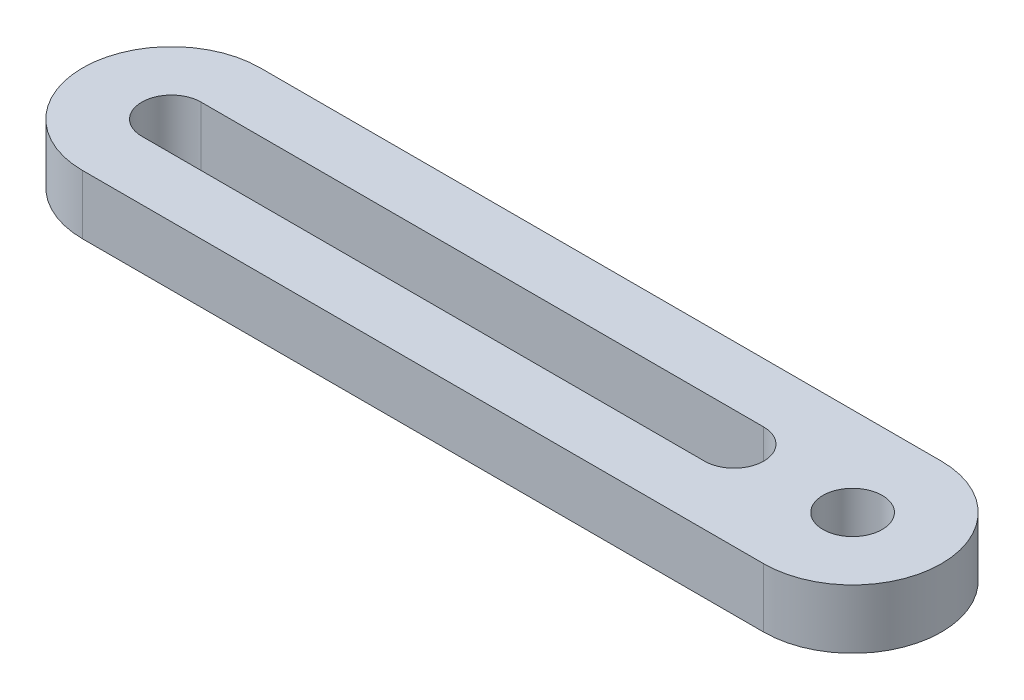
ISO-10303-21;
HEADER;
FILE_DESCRIPTION(('STEP AP214'),'2;1');
FILE_NAME('part.step','',(''),(''),'','','');
FILE_SCHEMA(('AUTOMOTIVE_DESIGN { 1 0 10303 214 1 1 1 1 }'));
ENDSEC;
DATA;
#1=APPLICATION_CONTEXT('core data for automotive mechanical design processes');
#2=APPLICATION_PROTOCOL_DEFINITION('international standard','automotive_design',2000,#1);
#3=PRODUCT_CONTEXT('',#1,'mechanical');
#4=PRODUCT('Part','Part','',(#3));
#5=PRODUCT_RELATED_PRODUCT_CATEGORY('part','',(#4));
#6=PRODUCT_DEFINITION_FORMATION('','',#4);
#7=PRODUCT_DEFINITION_CONTEXT('part definition',#1,'design');
#8=PRODUCT_DEFINITION('design','',#6,#7);
#9=PRODUCT_DEFINITION_SHAPE('','',#8);
#10=(LENGTH_UNIT() NAMED_UNIT(*) SI_UNIT(.MILLI.,.METRE.));
#11=(NAMED_UNIT(*) PLANE_ANGLE_UNIT() SI_UNIT($,.RADIAN.));
#12=(NAMED_UNIT(*) SI_UNIT($,.STERADIAN.) SOLID_ANGLE_UNIT());
#13=UNCERTAINTY_MEASURE_WITH_UNIT(LENGTH_MEASURE(1.E-05),#10,'distance_accuracy_value','');
#14=(GEOMETRIC_REPRESENTATION_CONTEXT(3) GLOBAL_UNCERTAINTY_ASSIGNED_CONTEXT((#13)) GLOBAL_UNIT_ASSIGNED_CONTEXT((#10,
#11,#12)) REPRESENTATION_CONTEXT('',''));
#15=CARTESIAN_POINT('',(0.,0.,0.));
#16=DIRECTION('',(0.,0.,1.));
#17=DIRECTION('',(1.,0.,0.));
#18=AXIS2_PLACEMENT_3D('',#15,#16,#17);
#19=CARTESIAN_POINT('',(0.,10.,0.));
#20=DIRECTION('',(0.,1.,0.));
#21=DIRECTION('',(0.,0.,1.));
#22=AXIS2_PLACEMENT_3D('',#19,#20,#21);
#23=PLANE('',#22);
#24=CARTESIAN_POINT('',(0.,10.,0.));
#25=DIRECTION('',(0.,1.,0.));
#26=DIRECTION('',(0.,0.,1.));
#27=AXIS2_PLACEMENT_3D('',#24,#25,#26);
#28=CIRCLE('',#27,15.);
#29=CARTESIAN_POINT('',(0.,10.,-15.));
#30=VERTEX_POINT('',#29);
#31=CARTESIAN_POINT('',(0.,10.,15.));
#32=VERTEX_POINT('',#31);
#33=EDGE_CURVE('E140',#30,#32,#28,.T.);
#34=ORIENTED_EDGE('',*,*,#33,.T.);
#35=DIRECTION('',(1.,0.,0.));
#36=VECTOR('',#35,1.);
#37=CARTESIAN_POINT('',(0.,10.,15.));
#38=LINE('',#37,#36);
#39=CARTESIAN_POINT('',(115.,10.,15.));
#40=VERTEX_POINT('',#39);
#41=EDGE_CURVE('E143',#32,#40,#38,.T.);
#42=ORIENTED_EDGE('',*,*,#41,.T.);
#43=CARTESIAN_POINT('',(115.,10.,0.));
#44=DIRECTION('',(0.,1.,0.));
#45=DIRECTION('',(0.,0.,1.));
#46=AXIS2_PLACEMENT_3D('',#43,#44,#45);
#47=CIRCLE('',#46,15.);
#48=CARTESIAN_POINT('',(115.,10.,-15.));
#49=VERTEX_POINT('',#48);
#50=EDGE_CURVE('E146',#40,#49,#47,.T.);
#51=ORIENTED_EDGE('',*,*,#50,.T.);
#52=DIRECTION('',(-1.,0.,0.));
#53=VECTOR('',#52,1.);
#54=CARTESIAN_POINT('',(0.,10.,-15.));
#55=LINE('',#54,#53);
#56=EDGE_CURVE('E148',#49,#30,#55,.T.);
#57=ORIENTED_EDGE('',*,*,#56,.T.);
#58=EDGE_LOOP('',(#34,#42,#51,#57));
#59=FACE_BOUND('',#58,.T.);
#60=CARTESIAN_POINT('',(115.,10.,0.));
#61=DIRECTION('',(0.,1.,0.));
#62=DIRECTION('',(0.,0.,1.));
#63=AXIS2_PLACEMENT_3D('',#60,#61,#62);
#64=CIRCLE('',#63,4.99999999999999);
#65=CARTESIAN_POINT('',(115.,10.,4.99999999999999));
#66=VERTEX_POINT('',#65);
#67=EDGE_CURVE('E134',#66,#66,#64,.T.);
#68=ORIENTED_EDGE('',*,*,#67,.F.);
#69=EDGE_LOOP('',(#68));
#70=FACE_BOUND('',#69,.T.);
#71=DIRECTION('',(1.,0.,0.));
#72=VECTOR('',#71,1.);
#73=CARTESIAN_POINT('',(0.,10.,5.));
#74=LINE('',#73,#72);
#75=CARTESIAN_POINT('',(0.,10.,5.));
#76=VERTEX_POINT('',#75);
#77=CARTESIAN_POINT('',(95.,10.,5.));
#78=VERTEX_POINT('',#77);
#79=EDGE_CURVE('E106',#76,#78,#74,.T.);
#80=ORIENTED_EDGE('',*,*,#79,.F.);
#81=CARTESIAN_POINT('',(0.,10.,0.));
#82=DIRECTION('',(0.,1.,0.));
#83=DIRECTION('',(0.,0.,1.));
#84=AXIS2_PLACEMENT_3D('',#81,#82,#83);
#85=CIRCLE('',#84,5.);
#86=CARTESIAN_POINT('',(0.,10.,-5.));
#87=VERTEX_POINT('',#86);
#88=EDGE_CURVE('E98',#87,#76,#85,.T.);
#89=ORIENTED_EDGE('',*,*,#88,.F.);
#90=DIRECTION('',(-1.,0.,0.));
#91=VECTOR('',#90,1.);
#92=CARTESIAN_POINT('',(0.,10.,-5.));
#93=LINE('',#92,#91);
#94=CARTESIAN_POINT('',(95.,10.,-5.));
#95=VERTEX_POINT('',#94);
#96=EDGE_CURVE('E120',#95,#87,#93,.T.);
#97=ORIENTED_EDGE('',*,*,#96,.F.);
#98=CARTESIAN_POINT('',(95.,10.,0.));
#99=DIRECTION('',(0.,1.,0.));
#100=DIRECTION('',(0.,0.,1.));
#101=AXIS2_PLACEMENT_3D('',#98,#99,#100);
#102=CIRCLE('',#101,5.);
#103=EDGE_CURVE('E118',#78,#95,#102,.T.);
#104=ORIENTED_EDGE('',*,*,#103,.F.);
#105=EDGE_LOOP('',(#80,#89,#97,#104));
#106=FACE_BOUND('',#105,.T.);
#107=ADVANCED_FACE('F33',(#59,#70,#106),#23,.T.);
#108=CARTESIAN_POINT('',(0.,0.,0.));
#109=DIRECTION('',(0.,1.,0.));
#110=DIRECTION('',(0.,0.,1.));
#111=AXIS2_PLACEMENT_3D('',#108,#109,#110);
#112=PLANE('',#111);
#113=CARTESIAN_POINT('',(115.,0.,0.));
#114=DIRECTION('',(0.,1.,0.));
#115=DIRECTION('',(0.,0.,1.));
#116=AXIS2_PLACEMENT_3D('',#113,#114,#115);
#117=CIRCLE('',#116,4.99999999999999);
#118=CARTESIAN_POINT('',(115.,0.,4.99999999999999));
#119=VERTEX_POINT('',#118);
#120=EDGE_CURVE('E114',#119,#119,#117,.T.);
#121=ORIENTED_EDGE('',*,*,#120,.T.);
#122=EDGE_LOOP('',(#121));
#123=FACE_BOUND('',#122,.T.);
#124=CARTESIAN_POINT('',(0.,0.,0.));
#125=DIRECTION('',(0.,1.,0.));
#126=DIRECTION('',(0.,0.,1.));
#127=AXIS2_PLACEMENT_3D('',#124,#125,#126);
#128=CIRCLE('',#127,15.);
#129=CARTESIAN_POINT('',(0.,0.,-15.));
#130=VERTEX_POINT('',#129);
#131=CARTESIAN_POINT('',(0.,0.,15.));
#132=VERTEX_POINT('',#131);
#133=EDGE_CURVE('E137',#130,#132,#128,.T.);
#134=ORIENTED_EDGE('',*,*,#133,.F.);
#135=DIRECTION('',(-1.,0.,0.));
#136=VECTOR('',#135,1.);
#137=CARTESIAN_POINT('',(0.,0.,-15.));
#138=LINE('',#137,#136);
#139=CARTESIAN_POINT('',(115.,0.,-15.));
#140=VERTEX_POINT('',#139);
#141=EDGE_CURVE('E144',#140,#130,#138,.T.);
#142=ORIENTED_EDGE('',*,*,#141,.F.);
#143=CARTESIAN_POINT('',(115.,0.,0.));
#144=DIRECTION('',(0.,1.,0.));
#145=DIRECTION('',(0.,0.,1.));
#146=AXIS2_PLACEMENT_3D('',#143,#144,#145);
#147=CIRCLE('',#146,15.);
#148=CARTESIAN_POINT('',(115.,0.,15.));
#149=VERTEX_POINT('',#148);
#150=EDGE_CURVE('E155',#149,#140,#147,.T.);
#151=ORIENTED_EDGE('',*,*,#150,.F.);
#152=DIRECTION('',(1.,0.,0.));
#153=VECTOR('',#152,1.);
#154=CARTESIAN_POINT('',(0.,0.,15.));
#155=LINE('',#154,#153);
#156=EDGE_CURVE('E153',#132,#149,#155,.T.);
#157=ORIENTED_EDGE('',*,*,#156,.F.);
#158=EDGE_LOOP('',(#134,#142,#151,#157));
#159=FACE_BOUND('',#158,.T.);
#160=CARTESIAN_POINT('',(0.,0.,0.));
#161=DIRECTION('',(0.,1.,0.));
#162=DIRECTION('',(0.,0.,1.));
#163=AXIS2_PLACEMENT_3D('',#160,#161,#162);
#164=CIRCLE('',#163,5.);
#165=CARTESIAN_POINT('',(0.,0.,-5.));
#166=VERTEX_POINT('',#165);
#167=CARTESIAN_POINT('',(0.,0.,5.));
#168=VERTEX_POINT('',#167);
#169=EDGE_CURVE('E56',#166,#168,#164,.T.);
#170=ORIENTED_EDGE('',*,*,#169,.T.);
#171=DIRECTION('',(1.,0.,0.));
#172=VECTOR('',#171,1.);
#173=CARTESIAN_POINT('',(0.,0.,5.));
#174=LINE('',#173,#172);
#175=CARTESIAN_POINT('',(95.,0.,5.));
#176=VERTEX_POINT('',#175);
#177=EDGE_CURVE('E113',#168,#176,#174,.T.);
#178=ORIENTED_EDGE('',*,*,#177,.T.);
#179=CARTESIAN_POINT('',(95.,0.,0.));
#180=DIRECTION('',(0.,1.,0.));
#181=DIRECTION('',(0.,0.,1.));
#182=AXIS2_PLACEMENT_3D('',#179,#180,#181);
#183=CIRCLE('',#182,5.);
#184=CARTESIAN_POINT('',(95.,0.,-5.));
#185=VERTEX_POINT('',#184);
#186=EDGE_CURVE('E126',#176,#185,#183,.T.);
#187=ORIENTED_EDGE('',*,*,#186,.T.);
#188=DIRECTION('',(-1.,0.,0.));
#189=VECTOR('',#188,1.);
#190=CARTESIAN_POINT('',(0.,0.,-5.));
#191=LINE('',#190,#189);
#192=EDGE_CURVE('E107',#185,#166,#191,.T.);
#193=ORIENTED_EDGE('',*,*,#192,.T.);
#194=EDGE_LOOP('',(#170,#178,#187,#193));
#195=FACE_BOUND('',#194,.T.);
#196=ADVANCED_FACE('F173',(#123,#159,#195),#112,.F.);
#197=CARTESIAN_POINT('',(0.,10.,0.));
#198=DIRECTION('',(0.,-1.,0.));
#199=DIRECTION('',(0.,0.,-1.));
#200=AXIS2_PLACEMENT_3D('',#197,#198,#199);
#201=CYLINDRICAL_SURFACE('',#200,15.);
#202=ORIENTED_EDGE('',*,*,#133,.T.);
#203=DIRECTION('',(0.,-1.,0.));
#204=VECTOR('',#203,1.);
#205=CARTESIAN_POINT('',(0.,10.,15.));
#206=LINE('',#205,#204);
#207=EDGE_CURVE('E11',#32,#132,#206,.T.);
#208=ORIENTED_EDGE('',*,*,#207,.F.);
#209=ORIENTED_EDGE('',*,*,#33,.F.);
#210=DIRECTION('',(0.,-1.,0.));
#211=VECTOR('',#210,1.);
#212=CARTESIAN_POINT('',(0.,10.,-15.));
#213=LINE('',#212,#211);
#214=EDGE_CURVE('E150',#30,#130,#213,.T.);
#215=ORIENTED_EDGE('',*,*,#214,.T.);
#216=EDGE_LOOP('',(#202,#208,#209,#215));
#217=FACE_BOUND('',#216,.T.);
#218=ADVANCED_FACE('F35',(#217),#201,.T.);
#219=CARTESIAN_POINT('',(0.,10.,15.));
#220=DIRECTION('',(0.,0.,-1.));
#221=DIRECTION('',(-1.,0.,0.));
#222=AXIS2_PLACEMENT_3D('',#219,#220,#221);
#223=PLANE('',#222);
#224=ORIENTED_EDGE('',*,*,#156,.T.);
#225=DIRECTION('',(0.,-1.,0.));
#226=VECTOR('',#225,1.);
#227=CARTESIAN_POINT('',(115.,10.,15.));
#228=LINE('',#227,#226);
#229=EDGE_CURVE('E41',#40,#149,#228,.T.);
#230=ORIENTED_EDGE('',*,*,#229,.F.);
#231=ORIENTED_EDGE('',*,*,#41,.F.);
#232=ORIENTED_EDGE('',*,*,#207,.T.);
#233=EDGE_LOOP('',(#224,#230,#231,#232));
#234=FACE_BOUND('',#233,.T.);
#235=ADVANCED_FACE('F184',(#234),#223,.F.);
#236=CARTESIAN_POINT('',(115.,10.,0.));
#237=DIRECTION('',(0.,-1.,0.));
#238=DIRECTION('',(0.,0.,-1.));
#239=AXIS2_PLACEMENT_3D('',#236,#237,#238);
#240=CYLINDRICAL_SURFACE('',#239,15.);
#241=ORIENTED_EDGE('',*,*,#150,.T.);
#242=DIRECTION('',(0.,-1.,0.));
#243=VECTOR('',#242,1.);
#244=CARTESIAN_POINT('',(115.,10.,-15.));
#245=LINE('',#244,#243);
#246=EDGE_CURVE('E160',#49,#140,#245,.T.);
#247=ORIENTED_EDGE('',*,*,#246,.F.);
#248=ORIENTED_EDGE('',*,*,#50,.F.);
#249=ORIENTED_EDGE('',*,*,#229,.T.);
#250=EDGE_LOOP('',(#241,#247,#248,#249));
#251=FACE_BOUND('',#250,.T.);
#252=ADVANCED_FACE('F167',(#251),#240,.T.);
#253=CARTESIAN_POINT('',(0.,10.,-15.));
#254=DIRECTION('',(0.,0.,1.));
#255=DIRECTION('',(1.,0.,0.));
#256=AXIS2_PLACEMENT_3D('',#253,#254,#255);
#257=PLANE('',#256);
#258=ORIENTED_EDGE('',*,*,#141,.T.);
#259=ORIENTED_EDGE('',*,*,#214,.F.);
#260=ORIENTED_EDGE('',*,*,#56,.F.);
#261=ORIENTED_EDGE('',*,*,#246,.T.);
#262=EDGE_LOOP('',(#258,#259,#260,#261));
#263=FACE_BOUND('',#262,.T.);
#264=ADVANCED_FACE('F177',(#263),#257,.F.);
#265=CARTESIAN_POINT('',(115.,10.,0.));
#266=DIRECTION('',(0.,-1.,0.));
#267=DIRECTION('',(0.,0.,-1.));
#268=AXIS2_PLACEMENT_3D('',#265,#266,#267);
#269=CYLINDRICAL_SURFACE('',#268,4.99999999999999);
#270=ORIENTED_EDGE('',*,*,#67,.T.);
#271=EDGE_LOOP('',(#270));
#272=FACE_BOUND('',#271,.T.);
#273=ORIENTED_EDGE('',*,*,#120,.F.);
#274=EDGE_LOOP('',(#273));
#275=FACE_BOUND('',#274,.T.);
#276=ADVANCED_FACE('F199',(#272,#275),#269,.F.);
#277=CARTESIAN_POINT('',(0.,10.,0.));
#278=DIRECTION('',(0.,-1.,0.));
#279=DIRECTION('',(0.,0.,-1.));
#280=AXIS2_PLACEMENT_3D('',#277,#278,#279);
#281=CYLINDRICAL_SURFACE('',#280,5.);
#282=ORIENTED_EDGE('',*,*,#169,.F.);
#283=DIRECTION('',(0.,-1.,0.));
#284=VECTOR('',#283,1.);
#285=CARTESIAN_POINT('',(0.,10.,-5.));
#286=LINE('',#285,#284);
#287=EDGE_CURVE('E102',#87,#166,#286,.T.);
#288=ORIENTED_EDGE('',*,*,#287,.F.);
#289=ORIENTED_EDGE('',*,*,#88,.T.);
#290=DIRECTION('',(0.,-1.,0.));
#291=VECTOR('',#290,1.);
#292=CARTESIAN_POINT('',(0.,10.,5.));
#293=LINE('',#292,#291);
#294=EDGE_CURVE('E101',#76,#168,#293,.T.);
#295=ORIENTED_EDGE('',*,*,#294,.T.);
#296=EDGE_LOOP('',(#282,#288,#289,#295));
#297=FACE_BOUND('',#296,.T.);
#298=ADVANCED_FACE('F100',(#297),#281,.F.);
#299=CARTESIAN_POINT('',(0.,10.,5.));
#300=DIRECTION('',(0.,0.,-1.));
#301=DIRECTION('',(-1.,0.,0.));
#302=AXIS2_PLACEMENT_3D('',#299,#300,#301);
#303=PLANE('',#302);
#304=ORIENTED_EDGE('',*,*,#177,.F.);
#305=ORIENTED_EDGE('',*,*,#294,.F.);
#306=ORIENTED_EDGE('',*,*,#79,.T.);
#307=DIRECTION('',(0.,-1.,0.));
#308=VECTOR('',#307,1.);
#309=CARTESIAN_POINT('',(95.,10.,5.));
#310=LINE('',#309,#308);
#311=EDGE_CURVE('E115',#78,#176,#310,.T.);
#312=ORIENTED_EDGE('',*,*,#311,.T.);
#313=EDGE_LOOP('',(#304,#305,#306,#312));
#314=FACE_BOUND('',#313,.T.);
#315=ADVANCED_FACE('F110',(#314),#303,.T.);
#316=CARTESIAN_POINT('',(95.,10.,0.));
#317=DIRECTION('',(0.,-1.,0.));
#318=DIRECTION('',(0.,0.,-1.));
#319=AXIS2_PLACEMENT_3D('',#316,#317,#318);
#320=CYLINDRICAL_SURFACE('',#319,5.);
#321=ORIENTED_EDGE('',*,*,#186,.F.);
#322=ORIENTED_EDGE('',*,*,#311,.F.);
#323=ORIENTED_EDGE('',*,*,#103,.T.);
#324=DIRECTION('',(0.,-1.,0.));
#325=VECTOR('',#324,1.);
#326=CARTESIAN_POINT('',(95.,10.,-5.));
#327=LINE('',#326,#325);
#328=EDGE_CURVE('E48',#95,#185,#327,.T.);
#329=ORIENTED_EDGE('',*,*,#328,.T.);
#330=EDGE_LOOP('',(#321,#322,#323,#329));
#331=FACE_BOUND('',#330,.T.);
#332=ADVANCED_FACE('F216',(#331),#320,.F.);
#333=CARTESIAN_POINT('',(0.,10.,-5.));
#334=DIRECTION('',(0.,0.,1.));
#335=DIRECTION('',(1.,0.,0.));
#336=AXIS2_PLACEMENT_3D('',#333,#334,#335);
#337=PLANE('',#336);
#338=ORIENTED_EDGE('',*,*,#192,.F.);
#339=ORIENTED_EDGE('',*,*,#328,.F.);
#340=ORIENTED_EDGE('',*,*,#96,.T.);
#341=ORIENTED_EDGE('',*,*,#287,.T.);
#342=EDGE_LOOP('',(#338,#339,#340,#341));
#343=FACE_BOUND('',#342,.T.);
#344=ADVANCED_FACE('F221',(#343),#337,.T.);
#345=CLOSED_SHELL('',(#107,#196,#218,#235,#252,#264,#276,#298,#315,#332,#344));
#346=MANIFOLD_SOLID_BREP('B2',#345);
#347=ADVANCED_BREP_SHAPE_REPRESENTATION('',(#18,#346),#14);
#348=SHAPE_DEFINITION_REPRESENTATION(#9,#347);
ENDSEC;
END-ISO-10303-21;
